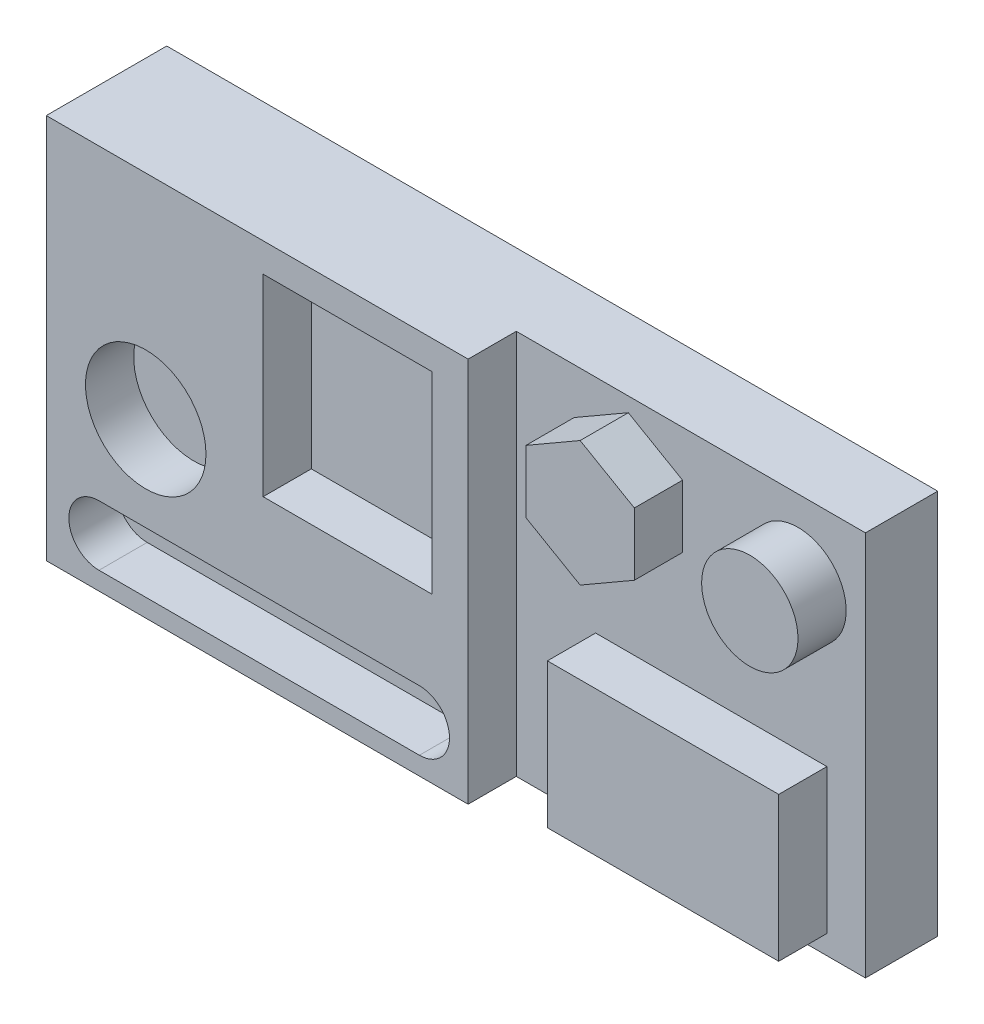
ISO-10303-21;
HEADER;
FILE_DESCRIPTION(('STEP AP214'),'2;1');
FILE_NAME('part.step','',(''),(''),'','','');
FILE_SCHEMA(('AUTOMOTIVE_DESIGN { 1 0 10303 214 1 1 1 1 }'));
ENDSEC;
DATA;
#1=APPLICATION_CONTEXT('core data for automotive mechanical design processes');
#2=APPLICATION_PROTOCOL_DEFINITION('international standard','automotive_design',2000,#1);
#3=PRODUCT_CONTEXT('',#1,'mechanical');
#4=PRODUCT('Part','Part','',(#3));
#5=PRODUCT_RELATED_PRODUCT_CATEGORY('part','',(#4));
#6=PRODUCT_DEFINITION_FORMATION('','',#4);
#7=PRODUCT_DEFINITION_CONTEXT('part definition',#1,'design');
#8=PRODUCT_DEFINITION('design','',#6,#7);
#9=PRODUCT_DEFINITION_SHAPE('','',#8);
#10=(LENGTH_UNIT() NAMED_UNIT(*) SI_UNIT(.MILLI.,.METRE.));
#11=(NAMED_UNIT(*) PLANE_ANGLE_UNIT() SI_UNIT($,.RADIAN.));
#12=(NAMED_UNIT(*) SI_UNIT($,.STERADIAN.) SOLID_ANGLE_UNIT());
#13=UNCERTAINTY_MEASURE_WITH_UNIT(LENGTH_MEASURE(1.E-05),#10,'distance_accuracy_value','');
#14=(GEOMETRIC_REPRESENTATION_CONTEXT(3) GLOBAL_UNCERTAINTY_ASSIGNED_CONTEXT((#13)) GLOBAL_UNIT_ASSIGNED_CONTEXT((#10,
#11,#12)) REPRESENTATION_CONTEXT('',''));
#15=CARTESIAN_POINT('',(0.,0.,0.));
#16=DIRECTION('',(0.,0.,1.));
#17=DIRECTION('',(1.,0.,0.));
#18=AXIS2_PLACEMENT_3D('',#15,#16,#17);
#19=CARTESIAN_POINT('',(0.,0.,19.05));
#20=DIRECTION('',(0.,0.,-1.));
#21=DIRECTION('',(-1.,0.,0.));
#22=AXIS2_PLACEMENT_3D('',#19,#20,#21);
#23=PLANE('',#22);
#24=DIRECTION('',(0.,-1.,0.));
#25=VECTOR('',#24,1.);
#26=CARTESIAN_POINT('',(30.48,-7.61999999999999,19.05));
#27=LINE('',#26,#25);
#28=CARTESIAN_POINT('',(30.48,-7.61999999999999,19.05));
#29=VERTEX_POINT('',#28);
#30=CARTESIAN_POINT('',(30.48,-45.72,19.05));
#31=VERTEX_POINT('',#30);
#32=EDGE_CURVE('E293',#29,#31,#27,.T.);
#33=ORIENTED_EDGE('',*,*,#32,.F.);
#34=DIRECTION('',(-1.,0.,0.));
#35=VECTOR('',#34,1.);
#36=CARTESIAN_POINT('',(30.48,-7.61999999999999,19.05));
#37=LINE('',#36,#35);
#38=CARTESIAN_POINT('',(91.44,-7.61999999999999,19.05));
#39=VERTEX_POINT('',#38);
#40=EDGE_CURVE('E298',#39,#29,#37,.T.);
#41=ORIENTED_EDGE('',*,*,#40,.F.);
#42=DIRECTION('',(0.,1.,0.));
#43=VECTOR('',#42,1.);
#44=CARTESIAN_POINT('',(91.44,-7.61999999999999,19.05));
#45=LINE('',#44,#43);
#46=CARTESIAN_POINT('',(91.44,-45.72,19.05));
#47=VERTEX_POINT('',#46);
#48=EDGE_CURVE('E310',#47,#39,#45,.T.);
#49=ORIENTED_EDGE('',*,*,#48,.F.);
#50=DIRECTION('',(1.,0.,0.));
#51=VECTOR('',#50,1.);
#52=CARTESIAN_POINT('',(30.48,-45.72,19.05));
#53=LINE('',#52,#51);
#54=EDGE_CURVE('E307',#31,#47,#53,.T.);
#55=ORIENTED_EDGE('',*,*,#54,.F.);
#56=EDGE_LOOP('',(#33,#41,#49,#55));
#57=FACE_BOUND('',#56,.T.);
#58=DIRECTION('',(-1.,0.,0.));
#59=VECTOR('',#58,1.);
#60=CARTESIAN_POINT('',(9.57931315075708,50.8,19.05));
#61=LINE('',#60,#59);
#62=CARTESIAN_POINT('',(101.6,50.8,19.05));
#63=VERTEX_POINT('',#62);
#64=CARTESIAN_POINT('',(9.57931315075708,50.8,19.05));
#65=VERTEX_POINT('',#64);
#66=EDGE_CURVE('E327',#63,#65,#61,.T.);
#67=ORIENTED_EDGE('',*,*,#66,.T.);
#68=DIRECTION('',(0.,-1.,0.));
#69=VECTOR('',#68,1.);
#70=CARTESIAN_POINT('',(9.57931315075708,50.8,19.05));
#71=LINE('',#70,#69);
#72=CARTESIAN_POINT('',(9.5793131507571,-50.8,19.05));
#73=VERTEX_POINT('',#72);
#74=EDGE_CURVE('E330',#65,#73,#71,.T.);
#75=ORIENTED_EDGE('',*,*,#74,.T.);
#76=DIRECTION('',(1.,0.,0.));
#77=VECTOR('',#76,1.);
#78=CARTESIAN_POINT('',(9.5793131507571,-50.8,19.05));
#79=LINE('',#78,#77);
#80=CARTESIAN_POINT('',(101.6,-50.8,19.05));
#81=VERTEX_POINT('',#80);
#82=EDGE_CURVE('E333',#73,#81,#79,.T.);
#83=ORIENTED_EDGE('',*,*,#82,.T.);
#84=DIRECTION('',(0.,1.,0.));
#85=VECTOR('',#84,1.);
#86=CARTESIAN_POINT('',(101.6,50.8,19.05));
#87=LINE('',#86,#85);
#88=EDGE_CURVE('E335',#81,#63,#87,.T.);
#89=ORIENTED_EDGE('',*,*,#88,.T.);
#90=EDGE_LOOP('',(#67,#75,#83,#89));
#91=FACE_BOUND('',#90,.T.);
#92=CARTESIAN_POINT('',(83.82,30.48,19.05));
#93=DIRECTION('',(0.,0.,-1.));
#94=DIRECTION('',(-1.,0.,0.));
#95=AXIS2_PLACEMENT_3D('',#92,#93,#94);
#96=CIRCLE('',#95,12.7);
#97=CARTESIAN_POINT('',(71.12,30.48,19.05));
#98=VERTEX_POINT('',#97);
#99=EDGE_CURVE('E11',#98,#98,#96,.F.);
#100=ORIENTED_EDGE('',*,*,#99,.F.);
#101=EDGE_LOOP('',(#100));
#102=FACE_BOUND('',#101,.T.);
#103=DIRECTION('',(-0.866025403784439,0.5,0.));
#104=VECTOR('',#103,1.);
#105=CARTESIAN_POINT('',(53.3943131507571,38.7288919710468,19.05));
#106=LINE('',#105,#104);
#107=CARTESIAN_POINT('',(53.3943131507571,38.7288919710468,19.05));
#108=VERTEX_POINT('',#107);
#109=CARTESIAN_POINT('',(39.1068131507571,46.9777839420936,19.05));
#110=VERTEX_POINT('',#109);
#111=EDGE_CURVE('E214',#108,#110,#106,.T.);
#112=ORIENTED_EDGE('',*,*,#111,.F.);
#113=DIRECTION('',(0.,1.,0.));
#114=VECTOR('',#113,1.);
#115=CARTESIAN_POINT('',(53.3943131507571,22.2311080289532,19.05));
#116=LINE('',#115,#114);
#117=CARTESIAN_POINT('',(53.3943131507571,22.2311080289532,19.05));
#118=VERTEX_POINT('',#117);
#119=EDGE_CURVE('E211',#118,#108,#116,.T.);
#120=ORIENTED_EDGE('',*,*,#119,.F.);
#121=DIRECTION('',(0.866025403784439,0.5,0.));
#122=VECTOR('',#121,1.);
#123=CARTESIAN_POINT('',(39.1068131507571,13.9822160579064,19.05));
#124=LINE('',#123,#122);
#125=CARTESIAN_POINT('',(39.1068131507571,13.9822160579064,19.05));
#126=VERTEX_POINT('',#125);
#127=EDGE_CURVE('E722',#126,#118,#124,.T.);
#128=ORIENTED_EDGE('',*,*,#127,.F.);
#129=DIRECTION('',(0.866025403784439,-0.5,0.));
#130=VECTOR('',#129,1.);
#131=CARTESIAN_POINT('',(24.8193131507571,22.2311080289532,19.05));
#132=LINE('',#131,#130);
#133=CARTESIAN_POINT('',(24.8193131507571,22.2311080289532,19.05));
#134=VERTEX_POINT('',#133);
#135=EDGE_CURVE('E737',#134,#126,#132,.T.);
#136=ORIENTED_EDGE('',*,*,#135,.F.);
#137=DIRECTION('',(0.,-1.,0.));
#138=VECTOR('',#137,1.);
#139=CARTESIAN_POINT('',(24.8193131507571,38.7288919710468,19.05));
#140=LINE('',#139,#138);
#141=CARTESIAN_POINT('',(24.8193131507571,38.7288919710468,19.05));
#142=VERTEX_POINT('',#141);
#143=EDGE_CURVE('E53',#142,#134,#140,.T.);
#144=ORIENTED_EDGE('',*,*,#143,.F.);
#145=DIRECTION('',(-0.866025403784439,-0.5,0.));
#146=VECTOR('',#145,1.);
#147=CARTESIAN_POINT('',(39.1068131507571,46.9777839420936,19.05));
#148=LINE('',#147,#146);
#149=EDGE_CURVE('E48',#110,#142,#148,.T.);
#150=ORIENTED_EDGE('',*,*,#149,.F.);
#151=EDGE_LOOP('',(#112,#120,#128,#136,#144,#150));
#152=FACE_BOUND('',#151,.T.);
#153=ADVANCED_FACE('F33',(#57,#91,#102,#152),#23,.F.);
#154=CARTESIAN_POINT('',(-101.6,50.8,31.75));
#155=DIRECTION('',(1.,0.,0.));
#156=DIRECTION('',(0.,1.,0.));
#157=AXIS2_PLACEMENT_3D('',#154,#155,#156);
#158=PLANE('',#157);
#159=DIRECTION('',(0.,-1.,0.));
#160=VECTOR('',#159,1.);
#161=CARTESIAN_POINT('',(-101.6,50.8,0.));
#162=LINE('',#161,#160);
#163=CARTESIAN_POINT('',(-101.6,50.8,0.));
#164=VERTEX_POINT('',#163);
#165=CARTESIAN_POINT('',(-101.6,-50.8,0.));
#166=VERTEX_POINT('',#165);
#167=EDGE_CURVE('E342',#164,#166,#162,.T.);
#168=ORIENTED_EDGE('',*,*,#167,.T.);
#169=DIRECTION('',(0.,0.,-1.));
#170=VECTOR('',#169,1.);
#171=CARTESIAN_POINT('',(-101.6,-50.8,31.75));
#172=LINE('',#171,#170);
#173=CARTESIAN_POINT('',(-101.6,-50.8,31.75));
#174=VERTEX_POINT('',#173);
#175=EDGE_CURVE('E41',#174,#166,#172,.T.);
#176=ORIENTED_EDGE('',*,*,#175,.F.);
#177=DIRECTION('',(0.,-1.,0.));
#178=VECTOR('',#177,1.);
#179=CARTESIAN_POINT('',(-101.6,50.8,31.75));
#180=LINE('',#179,#178);
#181=CARTESIAN_POINT('',(-101.6,50.8,31.75));
#182=VERTEX_POINT('',#181);
#183=EDGE_CURVE('E344',#182,#174,#180,.T.);
#184=ORIENTED_EDGE('',*,*,#183,.F.);
#185=DIRECTION('',(0.,0.,-1.));
#186=VECTOR('',#185,1.);
#187=CARTESIAN_POINT('',(-101.6,50.8,31.75));
#188=LINE('',#187,#186);
#189=EDGE_CURVE('E353',#182,#164,#188,.T.);
#190=ORIENTED_EDGE('',*,*,#189,.T.);
#191=EDGE_LOOP('',(#168,#176,#184,#190));
#192=FACE_BOUND('',#191,.T.);
#193=ADVANCED_FACE('F35',(#192),#158,.F.);
#194=CARTESIAN_POINT('',(-101.6,-50.8,31.75));
#195=DIRECTION('',(0.,1.,0.));
#196=DIRECTION('',(0.,0.,1.));
#197=AXIS2_PLACEMENT_3D('',#194,#195,#196);
#198=PLANE('',#197);
#199=ORIENTED_EDGE('',*,*,#82,.F.);
#200=DIRECTION('',(0.,0.,1.));
#201=VECTOR('',#200,1.);
#202=CARTESIAN_POINT('',(9.5793131507571,-50.8,19.05));
#203=LINE('',#202,#201);
#204=CARTESIAN_POINT('',(9.5793131507571,-50.8,31.75));
#205=VERTEX_POINT('',#204);
#206=EDGE_CURVE('E339',#73,#205,#203,.T.);
#207=ORIENTED_EDGE('',*,*,#206,.T.);
#208=DIRECTION('',(1.,0.,0.));
#209=VECTOR('',#208,1.);
#210=CARTESIAN_POINT('',(-101.6,-50.8,31.75));
#211=LINE('',#210,#209);
#212=EDGE_CURVE('E347',#174,#205,#211,.T.);
#213=ORIENTED_EDGE('',*,*,#212,.F.);
#214=ORIENTED_EDGE('',*,*,#175,.T.);
#215=DIRECTION('',(1.,0.,0.));
#216=VECTOR('',#215,1.);
#217=CARTESIAN_POINT('',(-101.6,-50.8,0.));
#218=LINE('',#217,#216);
#219=CARTESIAN_POINT('',(101.6,-50.8,0.));
#220=VERTEX_POINT('',#219);
#221=EDGE_CURVE('E356',#166,#220,#218,.T.);
#222=ORIENTED_EDGE('',*,*,#221,.T.);
#223=DIRECTION('',(0.,0.,-1.));
#224=VECTOR('',#223,1.);
#225=CARTESIAN_POINT('',(101.6,-50.8,31.75));
#226=LINE('',#225,#224);
#227=EDGE_CURVE('E367',#81,#220,#226,.T.);
#228=ORIENTED_EDGE('',*,*,#227,.F.);
#229=EDGE_LOOP('',(#199,#207,#213,#214,#222,#228));
#230=FACE_BOUND('',#229,.T.);
#231=ADVANCED_FACE('F372',(#230),#198,.F.);
#232=CARTESIAN_POINT('',(101.6,50.8,31.75));
#233=DIRECTION('',(-1.,0.,0.));
#234=DIRECTION('',(0.,-1.,0.));
#235=AXIS2_PLACEMENT_3D('',#232,#233,#234);
#236=PLANE('',#235);
#237=DIRECTION('',(0.,0.,-1.));
#238=VECTOR('',#237,1.);
#239=CARTESIAN_POINT('',(101.6,50.8,31.75));
#240=LINE('',#239,#238);
#241=CARTESIAN_POINT('',(101.6,50.8,0.));
#242=VERTEX_POINT('',#241);
#243=EDGE_CURVE('E365',#63,#242,#240,.T.);
#244=ORIENTED_EDGE('',*,*,#243,.F.);
#245=ORIENTED_EDGE('',*,*,#88,.F.);
#246=ORIENTED_EDGE('',*,*,#227,.T.);
#247=DIRECTION('',(0.,1.,0.));
#248=VECTOR('',#247,1.);
#249=CARTESIAN_POINT('',(101.6,50.8,0.));
#250=LINE('',#249,#248);
#251=EDGE_CURVE('E359',#220,#242,#250,.T.);
#252=ORIENTED_EDGE('',*,*,#251,.T.);
#253=EDGE_LOOP('',(#244,#245,#246,#252));
#254=FACE_BOUND('',#253,.T.);
#255=ADVANCED_FACE('F384',(#254),#236,.F.);
#256=CARTESIAN_POINT('',(-101.6,50.8,31.75));
#257=DIRECTION('',(0.,-1.,0.));
#258=DIRECTION('',(0.,0.,-1.));
#259=AXIS2_PLACEMENT_3D('',#256,#257,#258);
#260=PLANE('',#259);
#261=DIRECTION('',(-1.,0.,0.));
#262=VECTOR('',#261,1.);
#263=CARTESIAN_POINT('',(-101.6,50.8,31.75));
#264=LINE('',#263,#262);
#265=CARTESIAN_POINT('',(9.57931315075709,50.8,31.75));
#266=VERTEX_POINT('',#265);
#267=EDGE_CURVE('E351',#266,#182,#264,.T.);
#268=ORIENTED_EDGE('',*,*,#267,.F.);
#269=DIRECTION('',(0.,0.,1.));
#270=VECTOR('',#269,1.);
#271=CARTESIAN_POINT('',(9.57931315075708,50.8,19.05));
#272=LINE('',#271,#270);
#273=EDGE_CURVE('E337',#65,#266,#272,.T.);
#274=ORIENTED_EDGE('',*,*,#273,.F.);
#275=ORIENTED_EDGE('',*,*,#66,.F.);
#276=ORIENTED_EDGE('',*,*,#243,.T.);
#277=DIRECTION('',(-1.,0.,0.));
#278=VECTOR('',#277,1.);
#279=CARTESIAN_POINT('',(-101.6,50.8,0.));
#280=LINE('',#279,#278);
#281=EDGE_CURVE('E348',#242,#164,#280,.T.);
#282=ORIENTED_EDGE('',*,*,#281,.T.);
#283=ORIENTED_EDGE('',*,*,#189,.F.);
#284=EDGE_LOOP('',(#268,#274,#275,#276,#282,#283));
#285=FACE_BOUND('',#284,.T.);
#286=ADVANCED_FACE('F397',(#285),#260,.F.);
#287=CARTESIAN_POINT('',(0.,0.,31.75));
#288=DIRECTION('',(0.,0.,1.));
#289=DIRECTION('',(1.,0.,0.));
#290=AXIS2_PLACEMENT_3D('',#287,#288,#289);
#291=PLANE('',#290);
#292=CARTESIAN_POINT('',(-75.3875872668319,-5.43660485097344,31.75));
#293=DIRECTION('',(0.,0.,1.));
#294=DIRECTION('',(1.,0.,0.));
#295=AXIS2_PLACEMENT_3D('',#292,#293,#294);
#296=CIRCLE('',#295,15.875);
#297=CARTESIAN_POINT('',(-59.5125872668319,-5.43660485097344,31.75));
#298=VERTEX_POINT('',#297);
#299=EDGE_CURVE('E215',#298,#298,#296,.T.);
#300=ORIENTED_EDGE('',*,*,#299,.F.);
#301=EDGE_LOOP('',(#300));
#302=FACE_BOUND('',#301,.T.);
#303=DIRECTION('',(0.,-1.,0.));
#304=VECTOR('',#303,1.);
#305=CARTESIAN_POINT('',(-44.45,43.18,31.75));
#306=LINE('',#305,#304);
#307=CARTESIAN_POINT('',(-44.45,43.18,31.75));
#308=VERTEX_POINT('',#307);
#309=CARTESIAN_POINT('',(-44.45,-7.61999999999999,31.75));
#310=VERTEX_POINT('',#309);
#311=EDGE_CURVE('E225',#308,#310,#306,.T.);
#312=ORIENTED_EDGE('',*,*,#311,.F.);
#313=DIRECTION('',(-1.,0.,0.));
#314=VECTOR('',#313,1.);
#315=CARTESIAN_POINT('',(-44.45,43.18,31.75));
#316=LINE('',#315,#314);
#317=CARTESIAN_POINT('',(0.,43.18,31.75));
#318=VERTEX_POINT('',#317);
#319=EDGE_CURVE('E231',#318,#308,#316,.T.);
#320=ORIENTED_EDGE('',*,*,#319,.F.);
#321=DIRECTION('',(0.,1.,0.));
#322=VECTOR('',#321,1.);
#323=CARTESIAN_POINT('',(0.,43.18,31.75));
#324=LINE('',#323,#322);
#325=CARTESIAN_POINT('',(0.,-7.61999999999999,31.75));
#326=VERTEX_POINT('',#325);
#327=EDGE_CURVE('E245',#326,#318,#324,.T.);
#328=ORIENTED_EDGE('',*,*,#327,.F.);
#329=DIRECTION('',(1.,0.,0.));
#330=VECTOR('',#329,1.);
#331=CARTESIAN_POINT('',(-44.45,-7.61999999999999,31.75));
#332=LINE('',#331,#330);
#333=EDGE_CURVE('E242',#310,#326,#332,.T.);
#334=ORIENTED_EDGE('',*,*,#333,.F.);
#335=EDGE_LOOP('',(#312,#320,#328,#334));
#336=FACE_BOUND('',#335,.T.);
#337=CARTESIAN_POINT('',(-87.7105582623717,-38.1,31.75));
#338=DIRECTION('',(0.,0.,1.));
#339=DIRECTION('',(1.,0.,0.));
#340=AXIS2_PLACEMENT_3D('',#337,#338,#339);
#341=CIRCLE('',#340,7.9375);
#342=CARTESIAN_POINT('',(-87.7105582623717,-30.1625,31.75));
#343=VERTEX_POINT('',#342);
#344=CARTESIAN_POINT('',(-87.7105582623717,-46.0375,31.75));
#345=VERTEX_POINT('',#344);
#346=EDGE_CURVE('E252',#343,#345,#341,.T.);
#347=ORIENTED_EDGE('',*,*,#346,.F.);
#348=DIRECTION('',(-1.,0.,0.));
#349=VECTOR('',#348,1.);
#350=CARTESIAN_POINT('',(-87.7105582623717,-30.1625,31.75));
#351=LINE('',#350,#349);
#352=CARTESIAN_POINT('',(-3.26196291058411,-30.1625,31.75));
#353=VERTEX_POINT('',#352);
#354=EDGE_CURVE('E263',#353,#343,#351,.T.);
#355=ORIENTED_EDGE('',*,*,#354,.F.);
#356=CARTESIAN_POINT('',(-3.26196291058412,-38.1,31.75));
#357=DIRECTION('',(0.,0.,1.));
#358=DIRECTION('',(1.,0.,0.));
#359=AXIS2_PLACEMENT_3D('',#356,#357,#358);
#360=CIRCLE('',#359,7.9375);
#361=CARTESIAN_POINT('',(-3.26196291058412,-46.0375,31.75));
#362=VERTEX_POINT('',#361);
#363=EDGE_CURVE('E277',#362,#353,#360,.T.);
#364=ORIENTED_EDGE('',*,*,#363,.F.);
#365=DIRECTION('',(1.,0.,0.));
#366=VECTOR('',#365,1.);
#367=CARTESIAN_POINT('',(-87.7105582623717,-46.0375,31.75));
#368=LINE('',#367,#366);
#369=EDGE_CURVE('E274',#345,#362,#368,.T.);
#370=ORIENTED_EDGE('',*,*,#369,.F.);
#371=EDGE_LOOP('',(#347,#355,#364,#370));
#372=FACE_BOUND('',#371,.T.);
#373=DIRECTION('',(0.,-1.,0.));
#374=VECTOR('',#373,1.);
#375=CARTESIAN_POINT('',(9.57931315075708,50.8,31.75));
#376=LINE('',#375,#374);
#377=EDGE_CURVE('E326',#266,#205,#376,.T.);
#378=ORIENTED_EDGE('',*,*,#377,.F.);
#379=ORIENTED_EDGE('',*,*,#267,.T.);
#380=ORIENTED_EDGE('',*,*,#183,.T.);
#381=ORIENTED_EDGE('',*,*,#212,.T.);
#382=EDGE_LOOP('',(#378,#379,#380,#381));
#383=FACE_BOUND('',#382,.T.);
#384=ADVANCED_FACE('F395',(#302,#336,#372,#383),#291,.T.);
#385=CARTESIAN_POINT('',(0.,0.,0.));
#386=DIRECTION('',(0.,0.,1.));
#387=DIRECTION('',(1.,0.,0.));
#388=AXIS2_PLACEMENT_3D('',#385,#386,#387);
#389=PLANE('',#388);
#390=ORIENTED_EDGE('',*,*,#167,.F.);
#391=ORIENTED_EDGE('',*,*,#281,.F.);
#392=ORIENTED_EDGE('',*,*,#251,.F.);
#393=ORIENTED_EDGE('',*,*,#221,.F.);
#394=EDGE_LOOP('',(#390,#391,#392,#393));
#395=FACE_BOUND('',#394,.T.);
#396=ADVANCED_FACE('F381',(#395),#389,.F.);
#397=CARTESIAN_POINT('',(9.57931315075708,50.8,19.05));
#398=DIRECTION('',(-1.,0.,0.));
#399=DIRECTION('',(0.,-1.,0.));
#400=AXIS2_PLACEMENT_3D('',#397,#398,#399);
#401=PLANE('',#400);
#402=ORIENTED_EDGE('',*,*,#377,.T.);
#403=ORIENTED_EDGE('',*,*,#206,.F.);
#404=ORIENTED_EDGE('',*,*,#74,.F.);
#405=ORIENTED_EDGE('',*,*,#273,.T.);
#406=EDGE_LOOP('',(#402,#403,#404,#405));
#407=FACE_BOUND('',#406,.T.);
#408=ADVANCED_FACE('F391',(#407),#401,.F.);
#409=CARTESIAN_POINT('',(30.48,-7.61999999999999,31.75));
#410=DIRECTION('',(1.,0.,0.));
#411=DIRECTION('',(0.,1.,0.));
#412=AXIS2_PLACEMENT_3D('',#409,#410,#411);
#413=PLANE('',#412);
#414=ORIENTED_EDGE('',*,*,#32,.T.);
#415=DIRECTION('',(0.,0.,-1.));
#416=VECTOR('',#415,1.);
#417=CARTESIAN_POINT('',(30.48,-45.72,31.75));
#418=LINE('',#417,#416);
#419=CARTESIAN_POINT('',(30.48,-45.72,31.75));
#420=VERTEX_POINT('',#419);
#421=EDGE_CURVE('E323',#420,#31,#418,.T.);
#422=ORIENTED_EDGE('',*,*,#421,.F.);
#423=DIRECTION('',(0.,-1.,0.));
#424=VECTOR('',#423,1.);
#425=CARTESIAN_POINT('',(30.48,-7.61999999999999,31.75));
#426=LINE('',#425,#424);
#427=CARTESIAN_POINT('',(30.48,-7.61999999999999,31.75));
#428=VERTEX_POINT('',#427);
#429=EDGE_CURVE('E294',#428,#420,#426,.T.);
#430=ORIENTED_EDGE('',*,*,#429,.F.);
#431=DIRECTION('',(0.,0.,-1.));
#432=VECTOR('',#431,1.);
#433=CARTESIAN_POINT('',(30.48,-7.61999999999999,31.75));
#434=LINE('',#433,#432);
#435=EDGE_CURVE('E304',#428,#29,#434,.T.);
#436=ORIENTED_EDGE('',*,*,#435,.T.);
#437=EDGE_LOOP('',(#414,#422,#430,#436));
#438=FACE_BOUND('',#437,.T.);
#439=ADVANCED_FACE('F416',(#438),#413,.F.);
#440=CARTESIAN_POINT('',(30.48,-45.72,31.75));
#441=DIRECTION('',(0.,1.,0.));
#442=DIRECTION('',(0.,0.,1.));
#443=AXIS2_PLACEMENT_3D('',#440,#441,#442);
#444=PLANE('',#443);
#445=ORIENTED_EDGE('',*,*,#54,.T.);
#446=DIRECTION('',(0.,0.,-1.));
#447=VECTOR('',#446,1.);
#448=CARTESIAN_POINT('',(91.44,-45.72,31.75));
#449=LINE('',#448,#447);
#450=CARTESIAN_POINT('',(91.44,-45.72,31.75));
#451=VERTEX_POINT('',#450);
#452=EDGE_CURVE('E320',#451,#47,#449,.T.);
#453=ORIENTED_EDGE('',*,*,#452,.F.);
#454=DIRECTION('',(1.,0.,0.));
#455=VECTOR('',#454,1.);
#456=CARTESIAN_POINT('',(30.48,-45.72,31.75));
#457=LINE('',#456,#455);
#458=EDGE_CURVE('E297',#420,#451,#457,.T.);
#459=ORIENTED_EDGE('',*,*,#458,.F.);
#460=ORIENTED_EDGE('',*,*,#421,.T.);
#461=EDGE_LOOP('',(#445,#453,#459,#460));
#462=FACE_BOUND('',#461,.T.);
#463=ADVANCED_FACE('F436',(#462),#444,.F.);
#464=CARTESIAN_POINT('',(91.44,-7.61999999999999,31.75));
#465=DIRECTION('',(-1.,0.,0.));
#466=DIRECTION('',(0.,-1.,0.));
#467=AXIS2_PLACEMENT_3D('',#464,#465,#466);
#468=PLANE('',#467);
#469=ORIENTED_EDGE('',*,*,#48,.T.);
#470=DIRECTION('',(0.,0.,-1.));
#471=VECTOR('',#470,1.);
#472=CARTESIAN_POINT('',(91.44,-7.61999999999999,31.75));
#473=LINE('',#472,#471);
#474=CARTESIAN_POINT('',(91.44,-7.61999999999999,31.75));
#475=VERTEX_POINT('',#474);
#476=EDGE_CURVE('E317',#475,#39,#473,.T.);
#477=ORIENTED_EDGE('',*,*,#476,.F.);
#478=DIRECTION('',(0.,1.,0.));
#479=VECTOR('',#478,1.);
#480=CARTESIAN_POINT('',(91.44,-7.61999999999999,31.75));
#481=LINE('',#480,#479);
#482=EDGE_CURVE('E300',#451,#475,#481,.T.);
#483=ORIENTED_EDGE('',*,*,#482,.F.);
#484=ORIENTED_EDGE('',*,*,#452,.T.);
#485=EDGE_LOOP('',(#469,#477,#483,#484));
#486=FACE_BOUND('',#485,.T.);
#487=ADVANCED_FACE('F443',(#486),#468,.F.);
#488=CARTESIAN_POINT('',(30.48,-7.61999999999999,31.75));
#489=DIRECTION('',(0.,-1.,0.));
#490=DIRECTION('',(1.,0.,0.));
#491=AXIS2_PLACEMENT_3D('',#488,#489,#490);
#492=PLANE('',#491);
#493=ORIENTED_EDGE('',*,*,#40,.T.);
#494=ORIENTED_EDGE('',*,*,#435,.F.);
#495=DIRECTION('',(-1.,0.,0.));
#496=VECTOR('',#495,1.);
#497=CARTESIAN_POINT('',(30.48,-7.61999999999999,31.75));
#498=LINE('',#497,#496);
#499=EDGE_CURVE('E302',#475,#428,#498,.T.);
#500=ORIENTED_EDGE('',*,*,#499,.F.);
#501=ORIENTED_EDGE('',*,*,#476,.T.);
#502=EDGE_LOOP('',(#493,#494,#500,#501));
#503=FACE_BOUND('',#502,.T.);
#504=ADVANCED_FACE('F450',(#503),#492,.F.);
#505=CARTESIAN_POINT('',(0.,0.,31.75));
#506=DIRECTION('',(0.,0.,1.));
#507=DIRECTION('',(1.,0.,0.));
#508=AXIS2_PLACEMENT_3D('',#505,#506,#507);
#509=PLANE('',#508);
#510=ORIENTED_EDGE('',*,*,#429,.T.);
#511=ORIENTED_EDGE('',*,*,#458,.T.);
#512=ORIENTED_EDGE('',*,*,#482,.T.);
#513=ORIENTED_EDGE('',*,*,#499,.T.);
#514=EDGE_LOOP('',(#510,#511,#512,#513));
#515=FACE_BOUND('',#514,.T.);
#516=ADVANCED_FACE('F458',(#515),#509,.T.);
#517=CARTESIAN_POINT('',(83.82,30.48,31.75));
#518=DIRECTION('',(0.,0.,-1.));
#519=DIRECTION('',(-1.,0.,0.));
#520=AXIS2_PLACEMENT_3D('',#517,#518,#519);
#521=CYLINDRICAL_SURFACE('',#520,12.7);
#522=CARTESIAN_POINT('',(83.82,30.48,31.75));
#523=DIRECTION('',(0.,0.,1.));
#524=DIRECTION('',(1.,0.,0.));
#525=AXIS2_PLACEMENT_3D('',#522,#523,#524);
#526=CIRCLE('',#525,12.7);
#527=CARTESIAN_POINT('',(96.52,30.48,31.75));
#528=VERTEX_POINT('',#527);
#529=EDGE_CURVE('E284',#528,#528,#526,.T.);
#530=ORIENTED_EDGE('',*,*,#529,.F.);
#531=EDGE_LOOP('',(#530));
#532=FACE_BOUND('',#531,.T.);
#533=ORIENTED_EDGE('',*,*,#99,.T.);
#534=EDGE_LOOP('',(#533));
#535=FACE_BOUND('',#534,.T.);
#536=ADVANCED_FACE('F466',(#532,#535),#521,.T.);
#537=CARTESIAN_POINT('',(83.82,30.48,31.75));
#538=DIRECTION('',(0.,0.,1.));
#539=DIRECTION('',(1.,0.,0.));
#540=AXIS2_PLACEMENT_3D('',#537,#538,#539);
#541=PLANE('',#540);
#542=ORIENTED_EDGE('',*,*,#529,.T.);
#543=EDGE_LOOP('',(#542));
#544=FACE_BOUND('',#543,.T.);
#545=ADVANCED_FACE('F474',(#544),#541,.T.);
#546=CARTESIAN_POINT('',(-87.7105582623717,-38.1,19.05));
#547=DIRECTION('',(0.,0.,1.));
#548=DIRECTION('',(1.,0.,0.));
#549=AXIS2_PLACEMENT_3D('',#546,#547,#548);
#550=CYLINDRICAL_SURFACE('',#549,7.9375);
#551=ORIENTED_EDGE('',*,*,#346,.T.);
#552=DIRECTION('',(0.,0.,1.));
#553=VECTOR('',#552,1.);
#554=CARTESIAN_POINT('',(-87.7105582623717,-46.0375,19.05));
#555=LINE('',#554,#553);
#556=CARTESIAN_POINT('',(-87.7105582623717,-46.0375,19.05));
#557=VERTEX_POINT('',#556);
#558=EDGE_CURVE('E272',#557,#345,#555,.T.);
#559=ORIENTED_EDGE('',*,*,#558,.F.);
#560=CARTESIAN_POINT('',(-87.7105582623717,-38.1,19.05));
#561=DIRECTION('',(0.,0.,1.));
#562=DIRECTION('',(1.,0.,0.));
#563=AXIS2_PLACEMENT_3D('',#560,#561,#562);
#564=CIRCLE('',#563,7.9375);
#565=CARTESIAN_POINT('',(-87.7105582623717,-30.1625,19.05));
#566=VERTEX_POINT('',#565);
#567=EDGE_CURVE('E259',#566,#557,#564,.T.);
#568=ORIENTED_EDGE('',*,*,#567,.F.);
#569=DIRECTION('',(0.,0.,1.));
#570=VECTOR('',#569,1.);
#571=CARTESIAN_POINT('',(-87.7105582623717,-30.1625,19.05));
#572=LINE('',#571,#570);
#573=EDGE_CURVE('E282',#566,#343,#572,.T.);
#574=ORIENTED_EDGE('',*,*,#573,.T.);
#575=EDGE_LOOP('',(#551,#559,#568,#574));
#576=FACE_BOUND('',#575,.T.);
#577=ADVANCED_FACE('F482',(#576),#550,.F.);
#578=CARTESIAN_POINT('',(-87.7105582623717,-30.1625,19.05));
#579=DIRECTION('',(0.,1.,0.));
#580=DIRECTION('',(-1.,0.,0.));
#581=AXIS2_PLACEMENT_3D('',#578,#579,#580);
#582=PLANE('',#581);
#583=ORIENTED_EDGE('',*,*,#354,.T.);
#584=ORIENTED_EDGE('',*,*,#573,.F.);
#585=DIRECTION('',(-1.,0.,0.));
#586=VECTOR('',#585,1.);
#587=CARTESIAN_POINT('',(-87.7105582623717,-30.1625,19.05));
#588=LINE('',#587,#586);
#589=CARTESIAN_POINT('',(-3.26196291058411,-30.1625,19.05));
#590=VERTEX_POINT('',#589);
#591=EDGE_CURVE('E269',#590,#566,#588,.T.);
#592=ORIENTED_EDGE('',*,*,#591,.F.);
#593=DIRECTION('',(0.,0.,1.));
#594=VECTOR('',#593,1.);
#595=CARTESIAN_POINT('',(-3.26196291058411,-30.1625,19.05));
#596=LINE('',#595,#594);
#597=EDGE_CURVE('E285',#590,#353,#596,.T.);
#598=ORIENTED_EDGE('',*,*,#597,.T.);
#599=EDGE_LOOP('',(#583,#584,#592,#598));
#600=FACE_BOUND('',#599,.T.);
#601=ADVANCED_FACE('F490',(#600),#582,.F.);
#602=CARTESIAN_POINT('',(-3.26196291058412,-38.1,19.05));
#603=DIRECTION('',(0.,0.,1.));
#604=DIRECTION('',(1.,0.,0.));
#605=AXIS2_PLACEMENT_3D('',#602,#603,#604);
#606=CYLINDRICAL_SURFACE('',#605,7.9375);
#607=ORIENTED_EDGE('',*,*,#363,.T.);
#608=ORIENTED_EDGE('',*,*,#597,.F.);
#609=CARTESIAN_POINT('',(-3.26196291058412,-38.1,19.05));
#610=DIRECTION('',(0.,0.,1.));
#611=DIRECTION('',(1.,0.,0.));
#612=AXIS2_PLACEMENT_3D('',#609,#610,#611);
#613=CIRCLE('',#612,7.9375);
#614=CARTESIAN_POINT('',(-3.26196291058412,-46.0375,19.05));
#615=VERTEX_POINT('',#614);
#616=EDGE_CURVE('E266',#615,#590,#613,.T.);
#617=ORIENTED_EDGE('',*,*,#616,.F.);
#618=DIRECTION('',(0.,0.,1.));
#619=VECTOR('',#618,1.);
#620=CARTESIAN_POINT('',(-3.26196291058412,-46.0375,19.05));
#621=LINE('',#620,#619);
#622=EDGE_CURVE('E287',#615,#362,#621,.T.);
#623=ORIENTED_EDGE('',*,*,#622,.T.);
#624=EDGE_LOOP('',(#607,#608,#617,#623));
#625=FACE_BOUND('',#624,.T.);
#626=ADVANCED_FACE('F498',(#625),#606,.F.);
#627=CARTESIAN_POINT('',(-87.7105582623717,-46.0375,19.05));
#628=DIRECTION('',(0.,-1.,0.));
#629=DIRECTION('',(1.,0.,0.));
#630=AXIS2_PLACEMENT_3D('',#627,#628,#629);
#631=PLANE('',#630);
#632=ORIENTED_EDGE('',*,*,#369,.T.);
#633=ORIENTED_EDGE('',*,*,#622,.F.);
#634=DIRECTION('',(1.,0.,0.));
#635=VECTOR('',#634,1.);
#636=CARTESIAN_POINT('',(-87.7105582623717,-46.0375,19.05));
#637=LINE('',#636,#635);
#638=EDGE_CURVE('E262',#557,#615,#637,.T.);
#639=ORIENTED_EDGE('',*,*,#638,.F.);
#640=ORIENTED_EDGE('',*,*,#558,.T.);
#641=EDGE_LOOP('',(#632,#633,#639,#640));
#642=FACE_BOUND('',#641,.T.);
#643=ADVANCED_FACE('F506',(#642),#631,.F.);
#644=CARTESIAN_POINT('',(-87.7105582623717,-38.1,19.05));
#645=DIRECTION('',(0.,0.,1.));
#646=DIRECTION('',(1.,0.,0.));
#647=AXIS2_PLACEMENT_3D('',#644,#645,#646);
#648=PLANE('',#647);
#649=ORIENTED_EDGE('',*,*,#567,.T.);
#650=ORIENTED_EDGE('',*,*,#638,.T.);
#651=ORIENTED_EDGE('',*,*,#616,.T.);
#652=ORIENTED_EDGE('',*,*,#591,.T.);
#653=EDGE_LOOP('',(#649,#650,#651,#652));
#654=FACE_BOUND('',#653,.T.);
#655=ADVANCED_FACE('F514',(#654),#648,.T.);
#656=CARTESIAN_POINT('',(-44.45,43.18,19.05));
#657=DIRECTION('',(-1.,0.,0.));
#658=DIRECTION('',(0.,-1.,0.));
#659=AXIS2_PLACEMENT_3D('',#656,#657,#658);
#660=PLANE('',#659);
#661=ORIENTED_EDGE('',*,*,#311,.T.);
#662=DIRECTION('',(0.,0.,1.));
#663=VECTOR('',#662,1.);
#664=CARTESIAN_POINT('',(-44.45,-7.61999999999999,19.05));
#665=LINE('',#664,#663);
#666=CARTESIAN_POINT('',(-44.45,-7.61999999999999,19.05));
#667=VERTEX_POINT('',#666);
#668=EDGE_CURVE('E240',#667,#310,#665,.T.);
#669=ORIENTED_EDGE('',*,*,#668,.F.);
#670=DIRECTION('',(0.,-1.,0.));
#671=VECTOR('',#670,1.);
#672=CARTESIAN_POINT('',(-44.45,43.18,19.05));
#673=LINE('',#672,#671);
#674=CARTESIAN_POINT('',(-44.45,43.18,19.05));
#675=VERTEX_POINT('',#674);
#676=EDGE_CURVE('E227',#675,#667,#673,.T.);
#677=ORIENTED_EDGE('',*,*,#676,.F.);
#678=DIRECTION('',(0.,0.,1.));
#679=VECTOR('',#678,1.);
#680=CARTESIAN_POINT('',(-44.45,43.18,19.05));
#681=LINE('',#680,#679);
#682=EDGE_CURVE('E250',#675,#308,#681,.T.);
#683=ORIENTED_EDGE('',*,*,#682,.T.);
#684=EDGE_LOOP('',(#661,#669,#677,#683));
#685=FACE_BOUND('',#684,.T.);
#686=ADVANCED_FACE('F522',(#685),#660,.F.);
#687=CARTESIAN_POINT('',(-44.45,43.18,19.05));
#688=DIRECTION('',(0.,1.,0.));
#689=DIRECTION('',(0.,0.,1.));
#690=AXIS2_PLACEMENT_3D('',#687,#688,#689);
#691=PLANE('',#690);
#692=ORIENTED_EDGE('',*,*,#319,.T.);
#693=ORIENTED_EDGE('',*,*,#682,.F.);
#694=DIRECTION('',(-1.,0.,0.));
#695=VECTOR('',#694,1.);
#696=CARTESIAN_POINT('',(-44.45,43.18,19.05));
#697=LINE('',#696,#695);
#698=CARTESIAN_POINT('',(0.,43.18,19.05));
#699=VERTEX_POINT('',#698);
#700=EDGE_CURVE('E237',#699,#675,#697,.T.);
#701=ORIENTED_EDGE('',*,*,#700,.F.);
#702=DIRECTION('',(0.,0.,1.));
#703=VECTOR('',#702,1.);
#704=CARTESIAN_POINT('',(0.,43.18,19.05));
#705=LINE('',#704,#703);
#706=EDGE_CURVE('E253',#699,#318,#705,.T.);
#707=ORIENTED_EDGE('',*,*,#706,.T.);
#708=EDGE_LOOP('',(#692,#693,#701,#707));
#709=FACE_BOUND('',#708,.T.);
#710=ADVANCED_FACE('F530',(#709),#691,.F.);
#711=CARTESIAN_POINT('',(0.,43.18,19.05));
#712=DIRECTION('',(1.,0.,0.));
#713=DIRECTION('',(0.,1.,0.));
#714=AXIS2_PLACEMENT_3D('',#711,#712,#713);
#715=PLANE('',#714);
#716=ORIENTED_EDGE('',*,*,#327,.T.);
#717=ORIENTED_EDGE('',*,*,#706,.F.);
#718=DIRECTION('',(0.,1.,0.));
#719=VECTOR('',#718,1.);
#720=CARTESIAN_POINT('',(0.,43.18,19.05));
#721=LINE('',#720,#719);
#722=CARTESIAN_POINT('',(0.,-7.61999999999999,19.05));
#723=VERTEX_POINT('',#722);
#724=EDGE_CURVE('E234',#723,#699,#721,.T.);
#725=ORIENTED_EDGE('',*,*,#724,.F.);
#726=DIRECTION('',(0.,0.,1.));
#727=VECTOR('',#726,1.);
#728=CARTESIAN_POINT('',(0.,-7.61999999999999,19.05));
#729=LINE('',#728,#727);
#730=EDGE_CURVE('E255',#723,#326,#729,.T.);
#731=ORIENTED_EDGE('',*,*,#730,.T.);
#732=EDGE_LOOP('',(#716,#717,#725,#731));
#733=FACE_BOUND('',#732,.T.);
#734=ADVANCED_FACE('F538',(#733),#715,.F.);
#735=CARTESIAN_POINT('',(-44.45,-7.61999999999999,19.05));
#736=DIRECTION('',(0.,-1.,0.));
#737=DIRECTION('',(0.,0.,-1.));
#738=AXIS2_PLACEMENT_3D('',#735,#736,#737);
#739=PLANE('',#738);
#740=ORIENTED_EDGE('',*,*,#333,.T.);
#741=ORIENTED_EDGE('',*,*,#730,.F.);
#742=DIRECTION('',(1.,0.,0.));
#743=VECTOR('',#742,1.);
#744=CARTESIAN_POINT('',(-44.45,-7.61999999999999,19.05));
#745=LINE('',#744,#743);
#746=EDGE_CURVE('E230',#667,#723,#745,.T.);
#747=ORIENTED_EDGE('',*,*,#746,.F.);
#748=ORIENTED_EDGE('',*,*,#668,.T.);
#749=EDGE_LOOP('',(#740,#741,#747,#748));
#750=FACE_BOUND('',#749,.T.);
#751=ADVANCED_FACE('F546',(#750),#739,.F.);
#752=CARTESIAN_POINT('',(0.,0.,19.05));
#753=DIRECTION('',(0.,0.,1.));
#754=DIRECTION('',(1.,0.,0.));
#755=AXIS2_PLACEMENT_3D('',#752,#753,#754);
#756=PLANE('',#755);
#757=ORIENTED_EDGE('',*,*,#676,.T.);
#758=ORIENTED_EDGE('',*,*,#746,.T.);
#759=ORIENTED_EDGE('',*,*,#724,.T.);
#760=ORIENTED_EDGE('',*,*,#700,.T.);
#761=EDGE_LOOP('',(#757,#758,#759,#760));
#762=FACE_BOUND('',#761,.T.);
#763=ADVANCED_FACE('F554',(#762),#756,.T.);
#764=CARTESIAN_POINT('',(-75.3875872668319,-5.43660485097344,19.05));
#765=DIRECTION('',(0.,0.,1.));
#766=DIRECTION('',(1.,0.,0.));
#767=AXIS2_PLACEMENT_3D('',#764,#765,#766);
#768=CYLINDRICAL_SURFACE('',#767,15.875);
#769=CARTESIAN_POINT('',(-75.3875872668319,-5.43660485097344,19.05));
#770=DIRECTION('',(0.,0.,1.));
#771=DIRECTION('',(1.,0.,0.));
#772=AXIS2_PLACEMENT_3D('',#769,#770,#771);
#773=CIRCLE('',#772,15.875);
#774=CARTESIAN_POINT('',(-59.5125872668319,-5.43660485097344,19.05));
#775=VERTEX_POINT('',#774);
#776=EDGE_CURVE('E218',#775,#775,#773,.T.);
#777=ORIENTED_EDGE('',*,*,#776,.F.);
#778=EDGE_LOOP('',(#777));
#779=FACE_BOUND('',#778,.T.);
#780=ORIENTED_EDGE('',*,*,#299,.T.);
#781=EDGE_LOOP('',(#780));
#782=FACE_BOUND('',#781,.T.);
#783=ADVANCED_FACE('F562',(#779,#782),#768,.F.);
#784=CARTESIAN_POINT('',(-75.3875872668319,-5.43660485097344,19.05));
#785=DIRECTION('',(0.,0.,1.));
#786=DIRECTION('',(1.,0.,0.));
#787=AXIS2_PLACEMENT_3D('',#784,#785,#786);
#788=PLANE('',#787);
#789=ORIENTED_EDGE('',*,*,#776,.T.);
#790=EDGE_LOOP('',(#789));
#791=FACE_BOUND('',#790,.T.);
#792=ADVANCED_FACE('F570',(#791),#788,.T.);
#793=CARTESIAN_POINT('',(53.3943131507571,38.7288919710468,31.75));
#794=DIRECTION('',(-0.5,-0.866025403784439,0.));
#795=DIRECTION('',(0.866025403784439,-0.5,0.));
#796=AXIS2_PLACEMENT_3D('',#793,#794,#795);
#797=PLANE('',#796);
#798=ORIENTED_EDGE('',*,*,#111,.T.);
#799=DIRECTION('',(0.,0.,-1.));
#800=VECTOR('',#799,1.);
#801=CARTESIAN_POINT('',(39.1068131507571,46.9777839420936,31.75));
#802=LINE('',#801,#800);
#803=CARTESIAN_POINT('',(39.1068131507571,46.9777839420936,31.75));
#804=VERTEX_POINT('',#803);
#805=EDGE_CURVE('E195',#804,#110,#802,.T.);
#806=ORIENTED_EDGE('',*,*,#805,.F.);
#807=DIRECTION('',(-0.866025403784439,0.5,0.));
#808=VECTOR('',#807,1.);
#809=CARTESIAN_POINT('',(53.3943131507571,38.7288919710468,31.75));
#810=LINE('',#809,#808);
#811=CARTESIAN_POINT('',(53.3943131507571,38.7288919710468,31.75));
#812=VERTEX_POINT('',#811);
#813=EDGE_CURVE('E202',#812,#804,#810,.T.);
#814=ORIENTED_EDGE('',*,*,#813,.F.);
#815=DIRECTION('',(0.,0.,-1.));
#816=VECTOR('',#815,1.);
#817=CARTESIAN_POINT('',(53.3943131507571,38.7288919710468,31.75));
#818=LINE('',#817,#816);
#819=EDGE_CURVE('E718',#812,#108,#818,.T.);
#820=ORIENTED_EDGE('',*,*,#819,.T.);
#821=EDGE_LOOP('',(#798,#806,#814,#820));
#822=FACE_BOUND('',#821,.T.);
#823=ADVANCED_FACE('F213',(#822),#797,.F.);
#824=CARTESIAN_POINT('',(39.1068131507571,46.9777839420936,31.75));
#825=DIRECTION('',(0.5,-0.866025403784439,0.));
#826=DIRECTION('',(0.866025403784439,0.5,0.));
#827=AXIS2_PLACEMENT_3D('',#824,#825,#826);
#828=PLANE('',#827);
#829=ORIENTED_EDGE('',*,*,#149,.T.);
#830=DIRECTION('',(0.,0.,-1.));
#831=VECTOR('',#830,1.);
#832=CARTESIAN_POINT('',(24.8193131507571,38.7288919710468,31.75));
#833=LINE('',#832,#831);
#834=CARTESIAN_POINT('',(24.8193131507571,38.7288919710468,31.75));
#835=VERTEX_POINT('',#834);
#836=EDGE_CURVE('E198',#835,#142,#833,.T.);
#837=ORIENTED_EDGE('',*,*,#836,.F.);
#838=DIRECTION('',(-0.866025403784439,-0.5,0.));
#839=VECTOR('',#838,1.);
#840=CARTESIAN_POINT('',(39.1068131507571,46.9777839420936,31.75));
#841=LINE('',#840,#839);
#842=EDGE_CURVE('E191',#804,#835,#841,.T.);
#843=ORIENTED_EDGE('',*,*,#842,.F.);
#844=ORIENTED_EDGE('',*,*,#805,.T.);
#845=EDGE_LOOP('',(#829,#837,#843,#844));
#846=FACE_BOUND('',#845,.T.);
#847=ADVANCED_FACE('F193',(#846),#828,.F.);
#848=CARTESIAN_POINT('',(24.8193131507571,38.7288919710468,31.75));
#849=DIRECTION('',(1.,0.,0.));
#850=DIRECTION('',(0.,1.,0.));
#851=AXIS2_PLACEMENT_3D('',#848,#849,#850);
#852=PLANE('',#851);
#853=ORIENTED_EDGE('',*,*,#143,.T.);
#854=DIRECTION('',(0.,0.,-1.));
#855=VECTOR('',#854,1.);
#856=CARTESIAN_POINT('',(24.8193131507571,22.2311080289532,31.75));
#857=LINE('',#856,#855);
#858=CARTESIAN_POINT('',(24.8193131507571,22.2311080289532,31.75));
#859=VERTEX_POINT('',#858);
#860=EDGE_CURVE('E220',#859,#134,#857,.T.);
#861=ORIENTED_EDGE('',*,*,#860,.F.);
#862=DIRECTION('',(0.,-1.,0.));
#863=VECTOR('',#862,1.);
#864=CARTESIAN_POINT('',(24.8193131507571,38.7288919710468,31.75));
#865=LINE('',#864,#863);
#866=EDGE_CURVE('E201',#835,#859,#865,.T.);
#867=ORIENTED_EDGE('',*,*,#866,.F.);
#868=ORIENTED_EDGE('',*,*,#836,.T.);
#869=EDGE_LOOP('',(#853,#861,#867,#868));
#870=FACE_BOUND('',#869,.T.);
#871=ADVANCED_FACE('F591',(#870),#852,.F.);
#872=CARTESIAN_POINT('',(24.8193131507571,22.2311080289532,31.75));
#873=DIRECTION('',(0.5,0.866025403784439,0.));
#874=DIRECTION('',(-0.866025403784439,0.5,0.));
#875=AXIS2_PLACEMENT_3D('',#872,#873,#874);
#876=PLANE('',#875);
#877=ORIENTED_EDGE('',*,*,#135,.T.);
#878=DIRECTION('',(0.,0.,-1.));
#879=VECTOR('',#878,1.);
#880=CARTESIAN_POINT('',(39.1068131507571,13.9822160579064,31.75));
#881=LINE('',#880,#879);
#882=CARTESIAN_POINT('',(39.1068131507571,13.9822160579064,31.75));
#883=VERTEX_POINT('',#882);
#884=EDGE_CURVE('E725',#883,#126,#881,.T.);
#885=ORIENTED_EDGE('',*,*,#884,.F.);
#886=DIRECTION('',(0.866025403784439,-0.5,0.));
#887=VECTOR('',#886,1.);
#888=CARTESIAN_POINT('',(24.8193131507571,22.2311080289532,31.75));
#889=LINE('',#888,#887);
#890=EDGE_CURVE('E738',#859,#883,#889,.T.);
#891=ORIENTED_EDGE('',*,*,#890,.F.);
#892=ORIENTED_EDGE('',*,*,#860,.T.);
#893=EDGE_LOOP('',(#877,#885,#891,#892));
#894=FACE_BOUND('',#893,.T.);
#895=ADVANCED_FACE('F598',(#894),#876,.F.);
#896=CARTESIAN_POINT('',(39.1068131507571,13.9822160579064,31.75));
#897=DIRECTION('',(-0.5,0.866025403784439,0.));
#898=DIRECTION('',(-0.866025403784439,-0.5,0.));
#899=AXIS2_PLACEMENT_3D('',#896,#897,#898);
#900=PLANE('',#899);
#901=ORIENTED_EDGE('',*,*,#127,.T.);
#902=DIRECTION('',(0.,0.,-1.));
#903=VECTOR('',#902,1.);
#904=CARTESIAN_POINT('',(53.3943131507571,22.2311080289532,31.75));
#905=LINE('',#904,#903);
#906=CARTESIAN_POINT('',(53.3943131507571,22.2311080289532,31.75));
#907=VERTEX_POINT('',#906);
#908=EDGE_CURVE('E720',#907,#118,#905,.T.);
#909=ORIENTED_EDGE('',*,*,#908,.F.);
#910=DIRECTION('',(0.866025403784439,0.5,0.));
#911=VECTOR('',#910,1.);
#912=CARTESIAN_POINT('',(39.1068131507571,13.9822160579064,31.75));
#913=LINE('',#912,#911);
#914=EDGE_CURVE('E727',#883,#907,#913,.T.);
#915=ORIENTED_EDGE('',*,*,#914,.F.);
#916=ORIENTED_EDGE('',*,*,#884,.T.);
#917=EDGE_LOOP('',(#901,#909,#915,#916));
#918=FACE_BOUND('',#917,.T.);
#919=ADVANCED_FACE('F606',(#918),#900,.F.);
#920=CARTESIAN_POINT('',(53.3943131507571,22.2311080289532,31.75));
#921=DIRECTION('',(-1.,0.,0.));
#922=DIRECTION('',(0.,-1.,0.));
#923=AXIS2_PLACEMENT_3D('',#920,#921,#922);
#924=PLANE('',#923);
#925=ORIENTED_EDGE('',*,*,#119,.T.);
#926=ORIENTED_EDGE('',*,*,#819,.F.);
#927=DIRECTION('',(0.,1.,0.));
#928=VECTOR('',#927,1.);
#929=CARTESIAN_POINT('',(53.3943131507571,22.2311080289532,31.75));
#930=LINE('',#929,#928);
#931=EDGE_CURVE('E207',#907,#812,#930,.T.);
#932=ORIENTED_EDGE('',*,*,#931,.F.);
#933=ORIENTED_EDGE('',*,*,#908,.T.);
#934=EDGE_LOOP('',(#925,#926,#932,#933));
#935=FACE_BOUND('',#934,.T.);
#936=ADVANCED_FACE('F614',(#935),#924,.F.);
#937=CARTESIAN_POINT('',(0.,0.,31.75));
#938=DIRECTION('',(0.,0.,1.));
#939=DIRECTION('',(1.,0.,0.));
#940=AXIS2_PLACEMENT_3D('',#937,#938,#939);
#941=PLANE('',#940);
#942=ORIENTED_EDGE('',*,*,#813,.T.);
#943=ORIENTED_EDGE('',*,*,#842,.T.);
#944=ORIENTED_EDGE('',*,*,#866,.T.);
#945=ORIENTED_EDGE('',*,*,#890,.T.);
#946=ORIENTED_EDGE('',*,*,#914,.T.);
#947=ORIENTED_EDGE('',*,*,#931,.T.);
#948=EDGE_LOOP('',(#942,#943,#944,#945,#946,#947));
#949=FACE_BOUND('',#948,.T.);
#950=ADVANCED_FACE('F205',(#949),#941,.T.);
#951=CLOSED_SHELL('',(#153,#193,#231,#255,#286,#384,#396,#408,#439,#463,#487,#504,#516,#536,
#545,#577,#601,#626,#643,#655,#686,#710,#734,#751,#763,#783,#792,#823,#847,#871,#895,#919,#936,#950));
#952=MANIFOLD_SOLID_BREP('B2',#951);
#953=ADVANCED_BREP_SHAPE_REPRESENTATION('',(#18,#952),#14);
#954=SHAPE_DEFINITION_REPRESENTATION(#9,#953);
ENDSEC;
END-ISO-10303-21;
